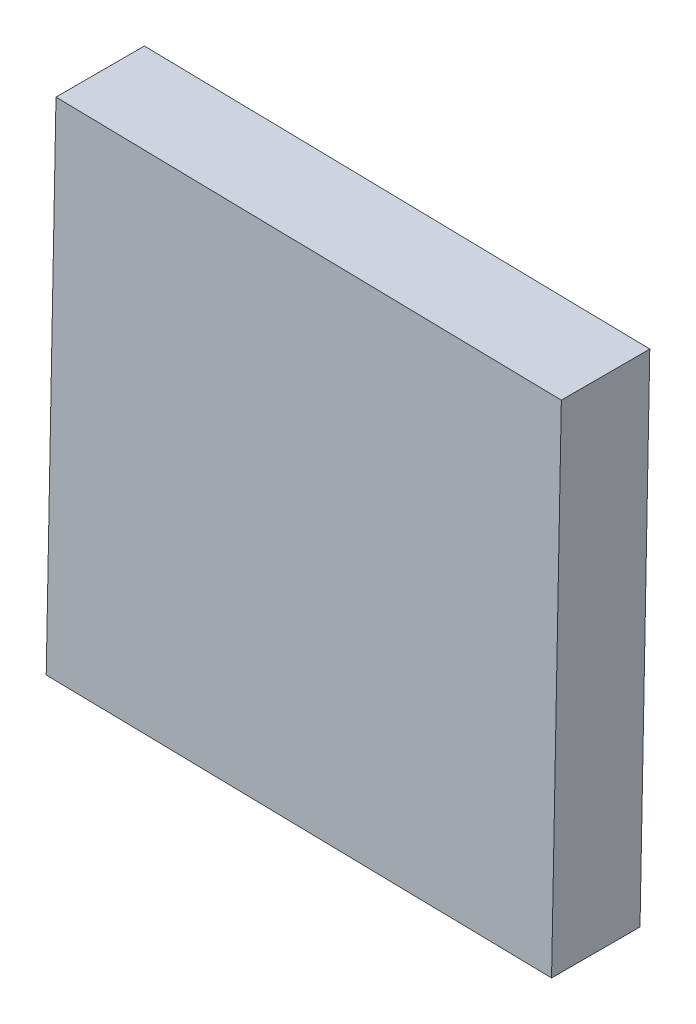
ISO-10303-21;
HEADER;
FILE_DESCRIPTION(('STEP AP214'),'2;1');
FILE_NAME('part.step','',(''),(''),'','','');
FILE_SCHEMA(('AUTOMOTIVE_DESIGN { 1 0 10303 214 1 1 1 1 }'));
ENDSEC;
DATA;
#1=APPLICATION_CONTEXT('core data for automotive mechanical design processes');
#2=APPLICATION_PROTOCOL_DEFINITION('international standard','automotive_design',2000,#1);
#3=PRODUCT_CONTEXT('',#1,'mechanical');
#4=PRODUCT('Part','Part','',(#3));
#5=PRODUCT_RELATED_PRODUCT_CATEGORY('part','',(#4));
#6=PRODUCT_DEFINITION_FORMATION('','',#4);
#7=PRODUCT_DEFINITION_CONTEXT('part definition',#1,'design');
#8=PRODUCT_DEFINITION('design','',#6,#7);
#9=PRODUCT_DEFINITION_SHAPE('','',#8);
#10=(LENGTH_UNIT() NAMED_UNIT(*) SI_UNIT(.MILLI.,.METRE.));
#11=(NAMED_UNIT(*) PLANE_ANGLE_UNIT() SI_UNIT($,.RADIAN.));
#12=(NAMED_UNIT(*) SI_UNIT($,.STERADIAN.) SOLID_ANGLE_UNIT());
#13=UNCERTAINTY_MEASURE_WITH_UNIT(LENGTH_MEASURE(1.E-05),#10,'distance_accuracy_value','');
#14=(GEOMETRIC_REPRESENTATION_CONTEXT(3) GLOBAL_UNCERTAINTY_ASSIGNED_CONTEXT((#13)) GLOBAL_UNIT_ASSIGNED_CONTEXT((#10,
#11,#12)) REPRESENTATION_CONTEXT('',''));
#15=CARTESIAN_POINT('',(0.,0.,0.));
#16=DIRECTION('',(0.,0.,1.));
#17=DIRECTION('',(1.,0.,0.));
#18=AXIS2_PLACEMENT_3D('',#15,#16,#17);
#19=CARTESIAN_POINT('',(-1.71244910615213,0.776448251307159,41.1510965279299));
#20=DIRECTION('',(0.,0.,1.));
#21=DIRECTION('',(0.999812677663925,-0.0193548335692301,0.));
#22=AXIS2_PLACEMENT_3D('',#19,#20,#21);
#23=PLANE('',#22);
#24=DIRECTION('',(0.0193548335692301,0.999812677663925,0.));
#25=VECTOR('',#24,1.);
#26=CARTESIAN_POINT('',(-4.30113458468434,-1.71391467269336,41.1510965279298));
#27=LINE('',#26,#25);
#28=CARTESIAN_POINT('',(-4.30113458468434,-1.71391467269336,41.1510965279298));
#29=VERTEX_POINT('',#28);
#30=CARTESIAN_POINT('',(-4.20281203015266,3.36513372983937,41.1510965279297));
#31=VERTEX_POINT('',#30);
#32=EDGE_CURVE('E57',#29,#31,#27,.T.);
#33=ORIENTED_EDGE('',*,*,#32,.T.);
#34=DIRECTION('',(0.999812677663925,-0.0193548335692299,0.));
#35=VECTOR('',#34,1.);
#36=CARTESIAN_POINT('',(-4.20281203015266,3.36513372983937,41.1510965279297));
#37=LINE('',#36,#35);
#38=CARTESIAN_POINT('',(0.876236372380084,3.26681117530768,41.1510965279299));
#39=VERTEX_POINT('',#38);
#40=EDGE_CURVE('E19',#31,#39,#37,.T.);
#41=ORIENTED_EDGE('',*,*,#40,.T.);
#42=DIRECTION('',(-0.0193548335692301,-0.999812677663925,0.));
#43=VECTOR('',#42,1.);
#44=CARTESIAN_POINT('',(0.777913817848395,-1.81223722722505,41.15109652793));
#45=LINE('',#44,#43);
#46=CARTESIAN_POINT('',(0.777913817848395,-1.81223722722505,41.15109652793));
#47=VERTEX_POINT('',#46);
#48=EDGE_CURVE('E87',#39,#47,#45,.T.);
#49=ORIENTED_EDGE('',*,*,#48,.T.);
#50=DIRECTION('',(-0.999812677663925,0.0193548335692299,0.));
#51=VECTOR('',#50,1.);
#52=CARTESIAN_POINT('',(-4.30113458468434,-1.71391467269336,41.1510965279298));
#53=LINE('',#52,#51);
#54=EDGE_CURVE('E55',#47,#29,#53,.T.);
#55=ORIENTED_EDGE('',*,*,#54,.T.);
#56=EDGE_LOOP('',(#33,#41,#49,#55));
#57=FACE_BOUND('',#56,.T.);
#58=ADVANCED_FACE('F16',(#57),#23,.F.);
#59=CARTESIAN_POINT('',(-4.20281203015269,3.36513372983939,42.0400965279297));
#60=DIRECTION('',(-0.0193548335692299,-0.999812677663925,0.));
#61=DIRECTION('',(0.999812677663925,-0.0193548335692299,0.));
#62=AXIS2_PLACEMENT_3D('',#59,#60,#61);
#63=PLANE('',#62);
#64=DIRECTION('',(0.,0.,1.));
#65=VECTOR('',#64,1.);
#66=CARTESIAN_POINT('',(0.876236372380056,3.2668111753077,42.0400965279299));
#67=LINE('',#66,#65);
#68=CARTESIAN_POINT('',(0.876236372380056,3.2668111753077,42.0400965279299));
#69=VERTEX_POINT('',#68);
#70=EDGE_CURVE('E69',#69,#39,#67,.F.);
#71=ORIENTED_EDGE('',*,*,#70,.T.);
#72=ORIENTED_EDGE('',*,*,#40,.F.);
#73=DIRECTION('',(0.,0.,1.));
#74=VECTOR('',#73,1.);
#75=CARTESIAN_POINT('',(-4.20281203015269,3.36513372983939,42.0400965279297));
#76=LINE('',#75,#74);
#77=CARTESIAN_POINT('',(-4.20281203015269,3.36513372983939,42.0400965279297));
#78=VERTEX_POINT('',#77);
#79=EDGE_CURVE('E64',#31,#78,#76,.T.);
#80=ORIENTED_EDGE('',*,*,#79,.T.);
#81=DIRECTION('',(0.999812677663925,-0.0193548335692301,0.));
#82=VECTOR('',#81,1.);
#83=CARTESIAN_POINT('',(-1.66328782888631,3.31597245257354,42.0400965279299));
#84=LINE('',#83,#82);
#85=EDGE_CURVE('E92',#69,#78,#84,.F.);
#86=ORIENTED_EDGE('',*,*,#85,.F.);
#87=EDGE_LOOP('',(#71,#72,#80,#86));
#88=FACE_BOUND('',#87,.T.);
#89=ADVANCED_FACE('F66',(#88),#63,.F.);
#90=CARTESIAN_POINT('',(-4.30113458468437,-1.71391467269335,42.0400965279298));
#91=DIRECTION('',(0.999812677663925,-0.0193548335692301,0.));
#92=DIRECTION('',(0.0193548335692301,0.999812677663925,0.));
#93=AXIS2_PLACEMENT_3D('',#90,#91,#92);
#94=PLANE('',#93);
#95=ORIENTED_EDGE('',*,*,#79,.F.);
#96=ORIENTED_EDGE('',*,*,#32,.F.);
#97=DIRECTION('',(0.,0.,1.));
#98=VECTOR('',#97,1.);
#99=CARTESIAN_POINT('',(-4.30113458468437,-1.71391467269335,42.0400965279298));
#100=LINE('',#99,#98);
#101=CARTESIAN_POINT('',(-4.30113458468437,-1.71391467269335,42.0400965279298));
#102=VERTEX_POINT('',#101);
#103=EDGE_CURVE('E81',#29,#102,#100,.T.);
#104=ORIENTED_EDGE('',*,*,#103,.T.);
#105=DIRECTION('',(0.0193548335692301,0.999812677663925,0.));
#106=VECTOR('',#105,1.);
#107=CARTESIAN_POINT('',(-4.25197330741853,0.825609528573017,42.0400965279298));
#108=LINE('',#107,#106);
#109=EDGE_CURVE('E74',#78,#102,#108,.F.);
#110=ORIENTED_EDGE('',*,*,#109,.F.);
#111=EDGE_LOOP('',(#95,#96,#104,#110));
#112=FACE_BOUND('',#111,.T.);
#113=ADVANCED_FACE('F72',(#112),#94,.F.);
#114=CARTESIAN_POINT('',(-4.30113458468437,-1.71391467269335,42.0400965279298));
#115=DIRECTION('',(0.0193548335692299,0.999812677663925,0.));
#116=DIRECTION('',(-0.999812677663925,0.0193548335692299,0.));
#117=AXIS2_PLACEMENT_3D('',#114,#115,#116);
#118=PLANE('',#117);
#119=ORIENTED_EDGE('',*,*,#103,.F.);
#120=ORIENTED_EDGE('',*,*,#54,.F.);
#121=DIRECTION('',(0.,0.,1.));
#122=VECTOR('',#121,1.);
#123=CARTESIAN_POINT('',(0.777913817848367,-1.81223722722504,42.04009652793));
#124=LINE('',#123,#122);
#125=CARTESIAN_POINT('',(0.777913817848367,-1.81223722722504,42.04009652793));
#126=VERTEX_POINT('',#125);
#127=EDGE_CURVE('E35',#47,#126,#124,.T.);
#128=ORIENTED_EDGE('',*,*,#127,.T.);
#129=DIRECTION('',(0.999812677663925,-0.0193548335692301,0.));
#130=VECTOR('',#129,1.);
#131=CARTESIAN_POINT('',(-1.76161038341801,-1.76307594995919,42.0400965279299));
#132=LINE('',#131,#130);
#133=EDGE_CURVE('E26',#102,#126,#132,.T.);
#134=ORIENTED_EDGE('',*,*,#133,.F.);
#135=EDGE_LOOP('',(#119,#120,#128,#134));
#136=FACE_BOUND('',#135,.T.);
#137=ADVANCED_FACE('F101',(#136),#118,.F.);
#138=CARTESIAN_POINT('',(0.777913817848367,-1.81223722722504,42.04009652793));
#139=DIRECTION('',(-0.999812677663925,0.0193548335692301,0.));
#140=DIRECTION('',(-0.0193548335692301,-0.999812677663925,0.));
#141=AXIS2_PLACEMENT_3D('',#138,#139,#140);
#142=PLANE('',#141);
#143=ORIENTED_EDGE('',*,*,#127,.F.);
#144=ORIENTED_EDGE('',*,*,#48,.F.);
#145=ORIENTED_EDGE('',*,*,#70,.F.);
#146=DIRECTION('',(0.0193548335692301,0.999812677663925,0.));
#147=VECTOR('',#146,1.);
#148=CARTESIAN_POINT('',(0.827075095114211,0.727286974041328,42.0400965279299));
#149=LINE('',#148,#147);
#150=EDGE_CURVE('E10',#126,#69,#149,.T.);
#151=ORIENTED_EDGE('',*,*,#150,.F.);
#152=EDGE_LOOP('',(#143,#144,#145,#151));
#153=FACE_BOUND('',#152,.T.);
#154=ADVANCED_FACE('F103',(#153),#142,.F.);
#155=CARTESIAN_POINT('',(-1.71244910615216,0.776448251307172,42.0400965279299));
#156=DIRECTION('',(0.,0.,1.));
#157=DIRECTION('',(0.999812677663925,-0.0193548335692301,0.));
#158=AXIS2_PLACEMENT_3D('',#155,#156,#157);
#159=PLANE('',#158);
#160=ORIENTED_EDGE('',*,*,#133,.T.);
#161=ORIENTED_EDGE('',*,*,#150,.T.);
#162=ORIENTED_EDGE('',*,*,#85,.T.);
#163=ORIENTED_EDGE('',*,*,#109,.T.);
#164=EDGE_LOOP('',(#160,#161,#162,#163));
#165=FACE_BOUND('',#164,.T.);
#166=ADVANCED_FACE('F100',(#165),#159,.T.);
#167=CLOSED_SHELL('',(#58,#89,#113,#137,#154,#166));
#168=MANIFOLD_SOLID_BREP('B1',#167);
#169=ADVANCED_BREP_SHAPE_REPRESENTATION('',(#18,#168),#14);
#170=SHAPE_DEFINITION_REPRESENTATION(#9,#169);
ENDSEC;
END-ISO-10303-21;
